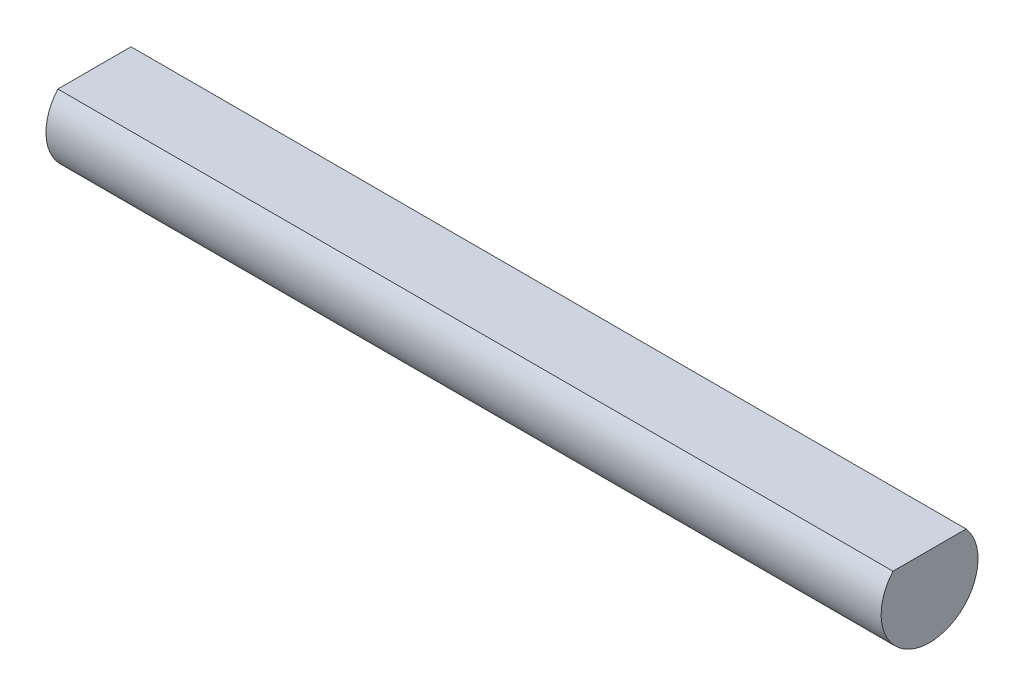
ISO-10303-21;
HEADER;
FILE_DESCRIPTION(('STEP AP214'),'2;1');
FILE_NAME('part.step','',(''),(''),'','','');
FILE_SCHEMA(('AUTOMOTIVE_DESIGN { 1 0 10303 214 1 1 1 1 }'));
ENDSEC;
DATA;
#1=APPLICATION_CONTEXT('core data for automotive mechanical design processes');
#2=APPLICATION_PROTOCOL_DEFINITION('international standard','automotive_design',2000,#1);
#3=PRODUCT_CONTEXT('',#1,'mechanical');
#4=PRODUCT('Part','Part','',(#3));
#5=PRODUCT_RELATED_PRODUCT_CATEGORY('part','',(#4));
#6=PRODUCT_DEFINITION_FORMATION('','',#4);
#7=PRODUCT_DEFINITION_CONTEXT('part definition',#1,'design');
#8=PRODUCT_DEFINITION('design','',#6,#7);
#9=PRODUCT_DEFINITION_SHAPE('','',#8);
#10=(LENGTH_UNIT() NAMED_UNIT(*) SI_UNIT(.MILLI.,.METRE.));
#11=(NAMED_UNIT(*) PLANE_ANGLE_UNIT() SI_UNIT($,.RADIAN.));
#12=(NAMED_UNIT(*) SI_UNIT($,.STERADIAN.) SOLID_ANGLE_UNIT());
#13=UNCERTAINTY_MEASURE_WITH_UNIT(LENGTH_MEASURE(1.E-05),#10,'distance_accuracy_value','');
#14=(GEOMETRIC_REPRESENTATION_CONTEXT(3) GLOBAL_UNCERTAINTY_ASSIGNED_CONTEXT((#13)) GLOBAL_UNIT_ASSIGNED_CONTEXT((#10,
#11,#12)) REPRESENTATION_CONTEXT('',''));
#15=CARTESIAN_POINT('',(0.,0.,0.));
#16=DIRECTION('',(0.,0.,1.));
#17=DIRECTION('',(1.,0.,0.));
#18=AXIS2_PLACEMENT_3D('',#15,#16,#17);
#19=CARTESIAN_POINT('',(-12.5,0.95,0.));
#20=DIRECTION('',(0.,-1.,0.));
#21=DIRECTION('',(0.,0.,-1.));
#22=AXIS2_PLACEMENT_3D('',#19,#20,#21);
#23=PLANE('',#22);
#24=DIRECTION('',(1.,0.,0.));
#25=VECTOR('',#24,1.);
#26=CARTESIAN_POINT('',(-12.5,0.95,1.09544511501033));
#27=LINE('',#26,#25);
#28=CARTESIAN_POINT('',(-12.5,0.95,1.09544511501033));
#29=VERTEX_POINT('',#28);
#30=CARTESIAN_POINT('',(12.5,0.95,1.09544511501033));
#31=VERTEX_POINT('',#30);
#32=EDGE_CURVE('E43',#29,#31,#27,.T.);
#33=ORIENTED_EDGE('',*,*,#32,.T.);
#34=DIRECTION('',(0.,0.,-1.));
#35=VECTOR('',#34,1.);
#36=CARTESIAN_POINT('',(12.5,0.95,0.));
#37=LINE('',#36,#35);
#38=CARTESIAN_POINT('',(12.5,0.95,-1.09544511501033));
#39=VERTEX_POINT('',#38);
#40=EDGE_CURVE('E68',#31,#39,#37,.T.);
#41=ORIENTED_EDGE('',*,*,#40,.T.);
#42=DIRECTION('',(1.,0.,0.));
#43=VECTOR('',#42,1.);
#44=CARTESIAN_POINT('',(-12.5,0.95,-1.09544511501033));
#45=LINE('',#44,#43);
#46=CARTESIAN_POINT('',(-12.5,0.95,-1.09544511501033));
#47=VERTEX_POINT('',#46);
#48=EDGE_CURVE('E11',#47,#39,#45,.T.);
#49=ORIENTED_EDGE('',*,*,#48,.F.);
#50=DIRECTION('',(0.,0.,-1.));
#51=VECTOR('',#50,1.);
#52=CARTESIAN_POINT('',(-12.5,0.95,0.));
#53=LINE('',#52,#51);
#54=EDGE_CURVE('E54',#29,#47,#53,.T.);
#55=ORIENTED_EDGE('',*,*,#54,.F.);
#56=EDGE_LOOP('',(#33,#41,#49,#55));
#57=FACE_BOUND('',#56,.T.);
#58=ADVANCED_FACE('F40',(#57),#23,.F.);
#59=CARTESIAN_POINT('',(-12.5,0.,0.));
#60=DIRECTION('',(1.,0.,0.));
#61=DIRECTION('',(0.,0.,-1.));
#62=AXIS2_PLACEMENT_3D('',#59,#60,#61);
#63=CYLINDRICAL_SURFACE('',#62,1.45);
#64=ORIENTED_EDGE('',*,*,#48,.T.);
#65=CARTESIAN_POINT('',(12.5,0.,0.));
#66=DIRECTION('',(1.,0.,0.));
#67=DIRECTION('',(0.,0.,-1.));
#68=AXIS2_PLACEMENT_3D('',#65,#66,#67);
#69=CIRCLE('',#68,1.45);
#70=EDGE_CURVE('E72',#31,#39,#69,.T.);
#71=ORIENTED_EDGE('',*,*,#70,.F.);
#72=ORIENTED_EDGE('',*,*,#32,.F.);
#73=CARTESIAN_POINT('',(-12.5,0.,0.));
#74=DIRECTION('',(1.,0.,0.));
#75=DIRECTION('',(0.,0.,-1.));
#76=AXIS2_PLACEMENT_3D('',#73,#74,#75);
#77=CIRCLE('',#76,1.45);
#78=EDGE_CURVE('E70',#29,#47,#77,.T.);
#79=ORIENTED_EDGE('',*,*,#78,.T.);
#80=EDGE_LOOP('',(#64,#71,#72,#79));
#81=FACE_BOUND('',#80,.T.);
#82=ADVANCED_FACE('F73',(#81),#63,.T.);
#83=CARTESIAN_POINT('',(-12.5,0.,0.));
#84=DIRECTION('',(1.,0.,0.));
#85=DIRECTION('',(0.,0.,-1.));
#86=AXIS2_PLACEMENT_3D('',#83,#84,#85);
#87=PLANE('',#86);
#88=ORIENTED_EDGE('',*,*,#54,.T.);
#89=ORIENTED_EDGE('',*,*,#78,.F.);
#90=EDGE_LOOP('',(#88,#89));
#91=FACE_BOUND('',#90,.T.);
#92=ADVANCED_FACE('F84',(#91),#87,.F.);
#93=CARTESIAN_POINT('',(12.5,0.,0.));
#94=DIRECTION('',(1.,0.,0.));
#95=DIRECTION('',(0.,0.,-1.));
#96=AXIS2_PLACEMENT_3D('',#93,#94,#95);
#97=PLANE('',#96);
#98=ORIENTED_EDGE('',*,*,#40,.F.);
#99=ORIENTED_EDGE('',*,*,#70,.T.);
#100=EDGE_LOOP('',(#98,#99));
#101=FACE_BOUND('',#100,.T.);
#102=ADVANCED_FACE('F77',(#101),#97,.T.);
#103=CLOSED_SHELL('',(#58,#82,#92,#102));
#104=MANIFOLD_SOLID_BREP('B2',#103);
#105=ADVANCED_BREP_SHAPE_REPRESENTATION('',(#18,#104),#14);
#106=SHAPE_DEFINITION_REPRESENTATION(#9,#105);
ENDSEC;
END-ISO-10303-21;
